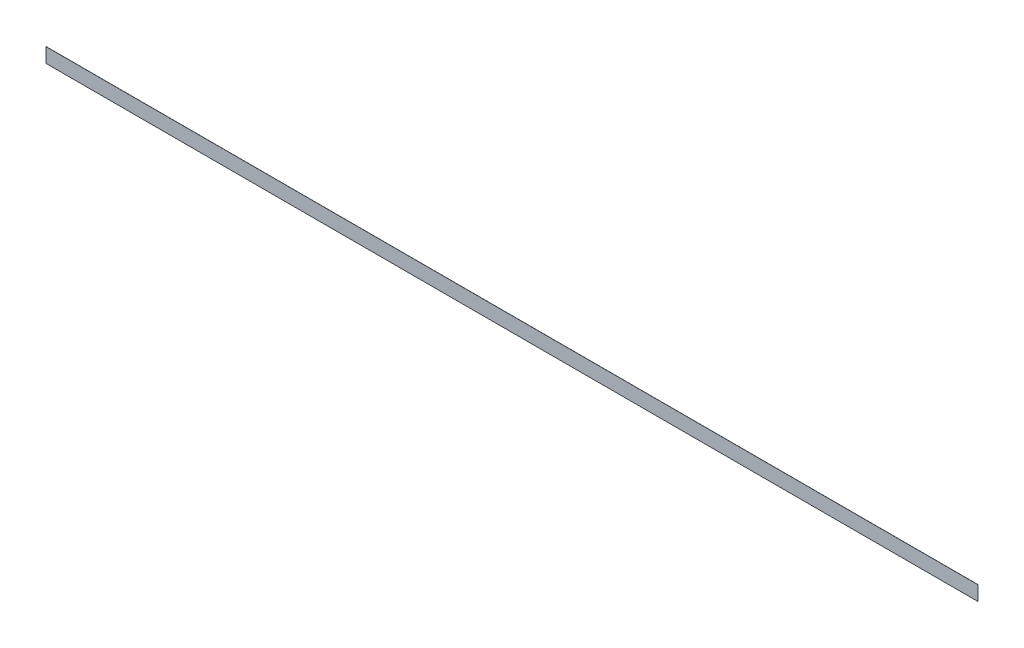
ISO-10303-21;
HEADER;
FILE_DESCRIPTION(('STEP AP214'),'2;1');
FILE_NAME('part.step','',(''),(''),'','','');
FILE_SCHEMA(('AUTOMOTIVE_DESIGN { 1 0 10303 214 1 1 1 1 }'));
ENDSEC;
DATA;
#1=APPLICATION_CONTEXT('core data for automotive mechanical design processes');
#2=APPLICATION_PROTOCOL_DEFINITION('international standard','automotive_design',2000,#1);
#3=PRODUCT_CONTEXT('',#1,'mechanical');
#4=PRODUCT('Part','Part','',(#3));
#5=PRODUCT_RELATED_PRODUCT_CATEGORY('part','',(#4));
#6=PRODUCT_DEFINITION_FORMATION('','',#4);
#7=PRODUCT_DEFINITION_CONTEXT('part definition',#1,'design');
#8=PRODUCT_DEFINITION('design','',#6,#7);
#9=PRODUCT_DEFINITION_SHAPE('','',#8);
#10=(LENGTH_UNIT() NAMED_UNIT(*) SI_UNIT(.MILLI.,.METRE.));
#11=(NAMED_UNIT(*) PLANE_ANGLE_UNIT() SI_UNIT($,.RADIAN.));
#12=(NAMED_UNIT(*) SI_UNIT($,.STERADIAN.) SOLID_ANGLE_UNIT());
#13=UNCERTAINTY_MEASURE_WITH_UNIT(LENGTH_MEASURE(1.E-05),#10,'distance_accuracy_value','');
#14=(GEOMETRIC_REPRESENTATION_CONTEXT(3) GLOBAL_UNCERTAINTY_ASSIGNED_CONTEXT((#13)) GLOBAL_UNIT_ASSIGNED_CONTEXT((#10,
#11,#12)) REPRESENTATION_CONTEXT('',''));
#15=CARTESIAN_POINT('',(0.,0.,0.));
#16=DIRECTION('',(0.,0.,1.));
#17=DIRECTION('',(1.,0.,0.));
#18=AXIS2_PLACEMENT_3D('',#15,#16,#17);
#19=CARTESIAN_POINT('',(-1624.0125,277.119915604592,0.));
#20=DIRECTION('',(0.,0.,1.));
#21=DIRECTION('',(1.,0.,0.));
#22=AXIS2_PLACEMENT_3D('',#19,#20,#21);
#23=PLANE('',#22);
#24=DIRECTION('',(0.,1.,0.));
#25=VECTOR('',#24,1.);
#26=CARTESIAN_POINT('',(-3248.025,277.119915604592,0.));
#27=LINE('',#26,#25);
#28=CARTESIAN_POINT('',(-3248.025,302.519915604592,0.));
#29=VERTEX_POINT('',#28);
#30=CARTESIAN_POINT('',(-3248.025,251.719915604592,0.));
#31=VERTEX_POINT('',#30);
#32=EDGE_CURVE('E76',#29,#31,#27,.F.);
#33=ORIENTED_EDGE('',*,*,#32,.F.);
#34=DIRECTION('',(1.,0.,0.));
#35=VECTOR('',#34,1.);
#36=CARTESIAN_POINT('',(-1624.0125,302.519915604592,0.));
#37=LINE('',#36,#35);
#38=CARTESIAN_POINT('',(0.,302.519915604592,0.));
#39=VERTEX_POINT('',#38);
#40=EDGE_CURVE('E65',#29,#39,#37,.T.);
#41=ORIENTED_EDGE('',*,*,#40,.T.);
#42=DIRECTION('',(0.,1.,0.));
#43=VECTOR('',#42,1.);
#44=CARTESIAN_POINT('',(0.,277.119915604592,0.));
#45=LINE('',#44,#43);
#46=CARTESIAN_POINT('',(0.,251.719915604592,0.));
#47=VERTEX_POINT('',#46);
#48=EDGE_CURVE('E53',#39,#47,#45,.F.);
#49=ORIENTED_EDGE('',*,*,#48,.T.);
#50=DIRECTION('',(1.,0.,0.));
#51=VECTOR('',#50,1.);
#52=CARTESIAN_POINT('',(-1624.0125,251.719915604592,0.));
#53=LINE('',#52,#51);
#54=EDGE_CURVE('E17',#31,#47,#53,.T.);
#55=ORIENTED_EDGE('',*,*,#54,.F.);
#56=EDGE_LOOP('',(#33,#41,#49,#55));
#57=FACE_BOUND('',#56,.T.);
#58=ADVANCED_FACE('F14',(#57),#23,.F.);
#59=CARTESIAN_POINT('',(-1624.0125,251.719915604592,0.396875));
#60=DIRECTION('',(0.,-1.,0.));
#61=DIRECTION('',(1.,0.,0.));
#62=AXIS2_PLACEMENT_3D('',#59,#60,#61);
#63=PLANE('',#62);
#64=DIRECTION('',(1.,0.,0.));
#65=VECTOR('',#64,1.);
#66=CARTESIAN_POINT('',(-1624.0125,251.719915604592,0.396875));
#67=LINE('',#66,#65);
#68=CARTESIAN_POINT('',(-3248.025,251.719915604592,0.396875));
#69=VERTEX_POINT('',#68);
#70=CARTESIAN_POINT('',(0.,251.719915604592,0.396875));
#71=VERTEX_POINT('',#70);
#72=EDGE_CURVE('E80',#69,#71,#67,.T.);
#73=ORIENTED_EDGE('',*,*,#72,.F.);
#74=DIRECTION('',(0.,0.,1.));
#75=VECTOR('',#74,1.);
#76=CARTESIAN_POINT('',(-3248.025,251.719915604592,0.396875));
#77=LINE('',#76,#75);
#78=EDGE_CURVE('E62',#31,#69,#77,.T.);
#79=ORIENTED_EDGE('',*,*,#78,.F.);
#80=ORIENTED_EDGE('',*,*,#54,.T.);
#81=DIRECTION('',(0.,0.,1.));
#82=VECTOR('',#81,1.);
#83=CARTESIAN_POINT('',(0.,251.719915604592,0.396875));
#84=LINE('',#83,#82);
#85=EDGE_CURVE('E59',#47,#71,#84,.T.);
#86=ORIENTED_EDGE('',*,*,#85,.T.);
#87=EDGE_LOOP('',(#73,#79,#80,#86));
#88=FACE_BOUND('',#87,.T.);
#89=ADVANCED_FACE('F58',(#88),#63,.T.);
#90=CARTESIAN_POINT('',(0.,277.119915604592,0.396875));
#91=DIRECTION('',(-1.,0.,0.));
#92=DIRECTION('',(0.,0.,1.));
#93=AXIS2_PLACEMENT_3D('',#90,#91,#92);
#94=PLANE('',#93);
#95=DIRECTION('',(0.,0.,1.));
#96=VECTOR('',#95,1.);
#97=CARTESIAN_POINT('',(0.,302.519915604592,0.396875));
#98=LINE('',#97,#96);
#99=CARTESIAN_POINT('',(0.,302.519915604592,0.396875));
#100=VERTEX_POINT('',#99);
#101=EDGE_CURVE('E67',#39,#100,#98,.T.);
#102=ORIENTED_EDGE('',*,*,#101,.T.);
#103=DIRECTION('',(0.,1.,0.));
#104=VECTOR('',#103,1.);
#105=CARTESIAN_POINT('',(0.,277.119915604592,0.396875));
#106=LINE('',#105,#104);
#107=EDGE_CURVE('E71',#71,#100,#106,.T.);
#108=ORIENTED_EDGE('',*,*,#107,.F.);
#109=ORIENTED_EDGE('',*,*,#85,.F.);
#110=ORIENTED_EDGE('',*,*,#48,.F.);
#111=EDGE_LOOP('',(#102,#108,#109,#110));
#112=FACE_BOUND('',#111,.T.);
#113=ADVANCED_FACE('F69',(#112),#94,.F.);
#114=CARTESIAN_POINT('',(-1624.0125,302.519915604592,0.396875));
#115=DIRECTION('',(0.,-1.,0.));
#116=DIRECTION('',(1.,0.,0.));
#117=AXIS2_PLACEMENT_3D('',#114,#115,#116);
#118=PLANE('',#117);
#119=DIRECTION('',(0.,0.,1.));
#120=VECTOR('',#119,1.);
#121=CARTESIAN_POINT('',(-3248.025,302.519915604591,0.396875));
#122=LINE('',#121,#120);
#123=CARTESIAN_POINT('',(-3248.025,302.519915604592,0.396875));
#124=VERTEX_POINT('',#123);
#125=EDGE_CURVE('E32',#124,#29,#122,.F.);
#126=ORIENTED_EDGE('',*,*,#125,.F.);
#127=DIRECTION('',(1.,0.,0.));
#128=VECTOR('',#127,1.);
#129=CARTESIAN_POINT('',(-1624.0125,302.519915604592,0.396875));
#130=LINE('',#129,#128);
#131=EDGE_CURVE('E23',#100,#124,#130,.F.);
#132=ORIENTED_EDGE('',*,*,#131,.F.);
#133=ORIENTED_EDGE('',*,*,#101,.F.);
#134=ORIENTED_EDGE('',*,*,#40,.F.);
#135=EDGE_LOOP('',(#126,#132,#133,#134));
#136=FACE_BOUND('',#135,.T.);
#137=ADVANCED_FACE('F86',(#136),#118,.F.);
#138=CARTESIAN_POINT('',(-3248.025,277.119915604592,0.396875));
#139=DIRECTION('',(-1.,0.,0.));
#140=DIRECTION('',(0.,0.,1.));
#141=AXIS2_PLACEMENT_3D('',#138,#139,#140);
#142=PLANE('',#141);
#143=DIRECTION('',(0.,1.,0.));
#144=VECTOR('',#143,1.);
#145=CARTESIAN_POINT('',(-3248.025,277.119915604592,0.396875));
#146=LINE('',#145,#144);
#147=EDGE_CURVE('E9',#124,#69,#146,.F.);
#148=ORIENTED_EDGE('',*,*,#147,.F.);
#149=ORIENTED_EDGE('',*,*,#125,.T.);
#150=ORIENTED_EDGE('',*,*,#32,.T.);
#151=ORIENTED_EDGE('',*,*,#78,.T.);
#152=EDGE_LOOP('',(#148,#149,#150,#151));
#153=FACE_BOUND('',#152,.T.);
#154=ADVANCED_FACE('F88',(#153),#142,.T.);
#155=CARTESIAN_POINT('',(-1624.0125,277.119915604592,0.396875));
#156=DIRECTION('',(0.,0.,1.));
#157=DIRECTION('',(1.,0.,0.));
#158=AXIS2_PLACEMENT_3D('',#155,#156,#157);
#159=PLANE('',#158);
#160=ORIENTED_EDGE('',*,*,#131,.T.);
#161=ORIENTED_EDGE('',*,*,#147,.T.);
#162=ORIENTED_EDGE('',*,*,#72,.T.);
#163=ORIENTED_EDGE('',*,*,#107,.T.);
#164=EDGE_LOOP('',(#160,#161,#162,#163));
#165=FACE_BOUND('',#164,.T.);
#166=ADVANCED_FACE('F85',(#165),#159,.T.);
#167=CLOSED_SHELL('',(#58,#89,#113,#137,#154,#166));
#168=MANIFOLD_SOLID_BREP('B1',#167);
#169=ADVANCED_BREP_SHAPE_REPRESENTATION('',(#18,#168),#14);
#170=SHAPE_DEFINITION_REPRESENTATION(#9,#169);
ENDSEC;
END-ISO-10303-21;
